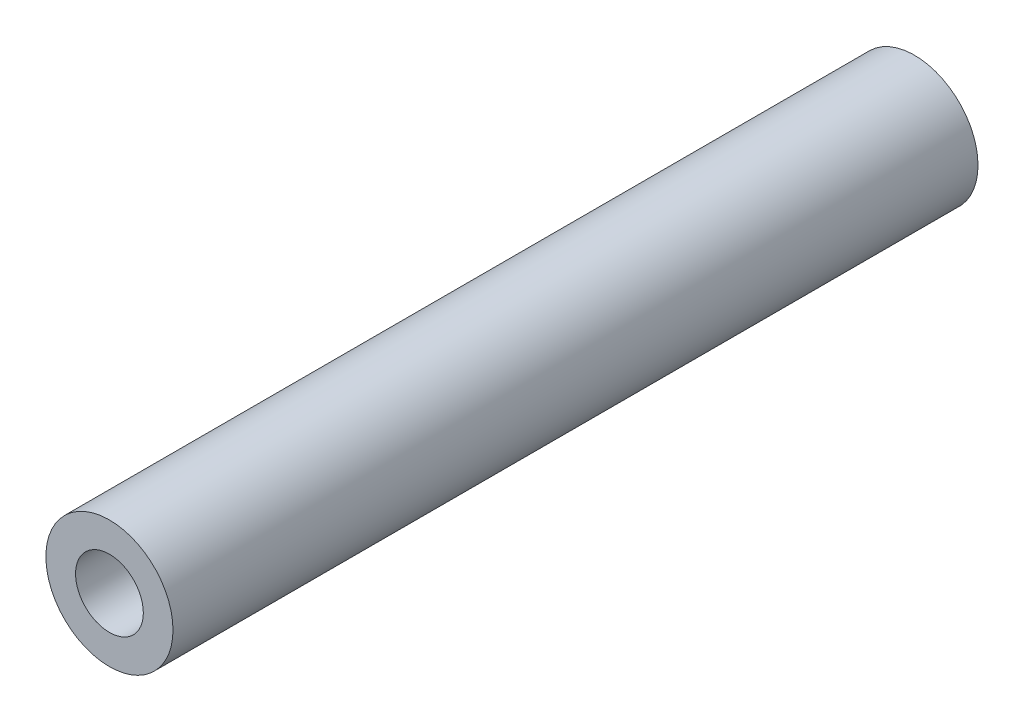
ISO-10303-21;
HEADER;
FILE_DESCRIPTION(('STEP AP214'),'2;1');
FILE_NAME('part.step','',(''),(''),'','','');
FILE_SCHEMA(('AUTOMOTIVE_DESIGN { 1 0 10303 214 1 1 1 1 }'));
ENDSEC;
DATA;
#1=APPLICATION_CONTEXT('core data for automotive mechanical design processes');
#2=APPLICATION_PROTOCOL_DEFINITION('international standard','automotive_design',2000,#1);
#3=PRODUCT_CONTEXT('',#1,'mechanical');
#4=PRODUCT('Part','Part','',(#3));
#5=PRODUCT_RELATED_PRODUCT_CATEGORY('part','',(#4));
#6=PRODUCT_DEFINITION_FORMATION('','',#4);
#7=PRODUCT_DEFINITION_CONTEXT('part definition',#1,'design');
#8=PRODUCT_DEFINITION('design','',#6,#7);
#9=PRODUCT_DEFINITION_SHAPE('','',#8);
#10=(LENGTH_UNIT() NAMED_UNIT(*) SI_UNIT(.MILLI.,.METRE.));
#11=(NAMED_UNIT(*) PLANE_ANGLE_UNIT() SI_UNIT($,.RADIAN.));
#12=(NAMED_UNIT(*) SI_UNIT($,.STERADIAN.) SOLID_ANGLE_UNIT());
#13=UNCERTAINTY_MEASURE_WITH_UNIT(LENGTH_MEASURE(1.E-05),#10,'distance_accuracy_value','');
#14=(GEOMETRIC_REPRESENTATION_CONTEXT(3) GLOBAL_UNCERTAINTY_ASSIGNED_CONTEXT((#13)) GLOBAL_UNIT_ASSIGNED_CONTEXT((#10,
#11,#12)) REPRESENTATION_CONTEXT('',''));
#15=CARTESIAN_POINT('',(0.,0.,0.));
#16=DIRECTION('',(0.,0.,1.));
#17=DIRECTION('',(1.,0.,0.));
#18=AXIS2_PLACEMENT_3D('',#15,#16,#17);
#19=CARTESIAN_POINT('',(0.,0.,19.));
#20=DIRECTION('',(0.,0.,-1.));
#21=DIRECTION('',(-1.,0.,0.));
#22=AXIS2_PLACEMENT_3D('',#19,#20,#21);
#23=CYLINDRICAL_SURFACE('',#22,3.);
#24=CARTESIAN_POINT('',(0.,0.,19.));
#25=DIRECTION('',(0.,0.,1.));
#26=DIRECTION('',(1.,0.,0.));
#27=AXIS2_PLACEMENT_3D('',#24,#25,#26);
#28=CIRCLE('',#27,3.);
#29=CARTESIAN_POINT('',(3.,0.,19.));
#30=VERTEX_POINT('',#29);
#31=EDGE_CURVE('E10',#30,#30,#28,.T.);
#32=ORIENTED_EDGE('',*,*,#31,.F.);
#33=EDGE_LOOP('',(#32));
#34=FACE_BOUND('',#33,.T.);
#35=CARTESIAN_POINT('',(0.,0.,-19.));
#36=DIRECTION('',(0.,0.,1.));
#37=DIRECTION('',(1.,0.,0.));
#38=AXIS2_PLACEMENT_3D('',#35,#36,#37);
#39=CIRCLE('',#38,3.);
#40=CARTESIAN_POINT('',(3.,0.,-19.));
#41=VERTEX_POINT('',#40);
#42=EDGE_CURVE('E42',#41,#41,#39,.T.);
#43=ORIENTED_EDGE('',*,*,#42,.T.);
#44=EDGE_LOOP('',(#43));
#45=FACE_BOUND('',#44,.T.);
#46=ADVANCED_FACE('F39',(#34,#45),#23,.T.);
#47=CARTESIAN_POINT('',(0.,0.,19.));
#48=DIRECTION('',(0.,0.,1.));
#49=DIRECTION('',(1.,0.,0.));
#50=AXIS2_PLACEMENT_3D('',#47,#48,#49);
#51=PLANE('',#50);
#52=CARTESIAN_POINT('',(0.,0.,19.));
#53=DIRECTION('',(0.,0.,1.));
#54=DIRECTION('',(1.,0.,0.));
#55=AXIS2_PLACEMENT_3D('',#52,#53,#54);
#56=CIRCLE('',#55,1.6);
#57=CARTESIAN_POINT('',(1.6,0.,19.));
#58=VERTEX_POINT('',#57);
#59=EDGE_CURVE('E53',#58,#58,#56,.T.);
#60=ORIENTED_EDGE('',*,*,#59,.F.);
#61=EDGE_LOOP('',(#60));
#62=FACE_BOUND('',#61,.T.);
#63=ORIENTED_EDGE('',*,*,#31,.T.);
#64=EDGE_LOOP('',(#63));
#65=FACE_BOUND('',#64,.T.);
#66=ADVANCED_FACE('F59',(#62,#65),#51,.T.);
#67=CARTESIAN_POINT('',(0.,0.,-19.));
#68=DIRECTION('',(0.,0.,1.));
#69=DIRECTION('',(1.,0.,0.));
#70=AXIS2_PLACEMENT_3D('',#67,#68,#69);
#71=PLANE('',#70);
#72=CARTESIAN_POINT('',(0.,0.,-19.));
#73=DIRECTION('',(0.,0.,1.));
#74=DIRECTION('',(1.,0.,0.));
#75=AXIS2_PLACEMENT_3D('',#72,#73,#74);
#76=CIRCLE('',#75,1.59999999999999);
#77=CARTESIAN_POINT('',(1.59999999999999,0.,-19.));
#78=VERTEX_POINT('',#77);
#79=EDGE_CURVE('E49',#78,#78,#76,.T.);
#80=ORIENTED_EDGE('',*,*,#79,.T.);
#81=EDGE_LOOP('',(#80));
#82=FACE_BOUND('',#81,.T.);
#83=ORIENTED_EDGE('',*,*,#42,.F.);
#84=EDGE_LOOP('',(#83));
#85=FACE_BOUND('',#84,.T.);
#86=ADVANCED_FACE('F61',(#82,#85),#71,.F.);
#87=CARTESIAN_POINT('',(0.,0.,19.));
#88=DIRECTION('',(0.,0.,1.));
#89=DIRECTION('',(1.,0.,0.));
#90=AXIS2_PLACEMENT_3D('',#87,#88,#89);
#91=CYLINDRICAL_SURFACE('',#90,1.59999999999999);
#92=ORIENTED_EDGE('',*,*,#79,.F.);
#93=EDGE_LOOP('',(#92));
#94=FACE_BOUND('',#93,.T.);
#95=ORIENTED_EDGE('',*,*,#59,.T.);
#96=EDGE_LOOP('',(#95));
#97=FACE_BOUND('',#96,.T.);
#98=ADVANCED_FACE('F57',(#94,#97),#91,.F.);
#99=CLOSED_SHELL('',(#46,#66,#86,#98));
#100=MANIFOLD_SOLID_BREP('B2',#99);
#101=ADVANCED_BREP_SHAPE_REPRESENTATION('',(#18,#100),#14);
#102=SHAPE_DEFINITION_REPRESENTATION(#9,#101);
ENDSEC;
END-ISO-10303-21;
